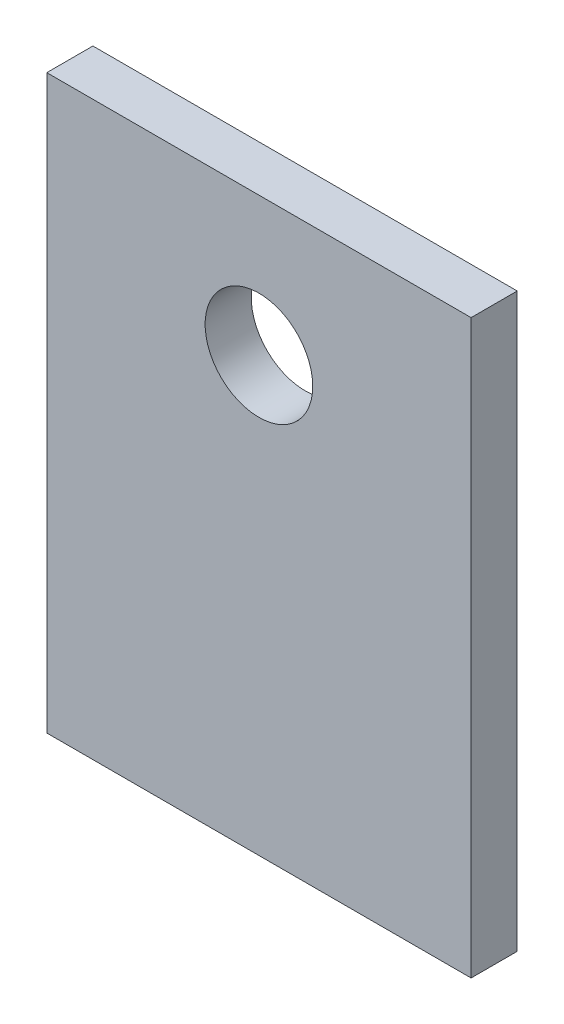
ISO-10303-21;
HEADER;
FILE_DESCRIPTION(('STEP AP214'),'2;1');
FILE_NAME('part.step','',(''),(''),'','','');
FILE_SCHEMA(('AUTOMOTIVE_DESIGN { 1 0 10303 214 1 1 1 1 }'));
ENDSEC;
DATA;
#1=APPLICATION_CONTEXT('core data for automotive mechanical design processes');
#2=APPLICATION_PROTOCOL_DEFINITION('international standard','automotive_design',2000,#1);
#3=PRODUCT_CONTEXT('',#1,'mechanical');
#4=PRODUCT('Part','Part','',(#3));
#5=PRODUCT_RELATED_PRODUCT_CATEGORY('part','',(#4));
#6=PRODUCT_DEFINITION_FORMATION('','',#4);
#7=PRODUCT_DEFINITION_CONTEXT('part definition',#1,'design');
#8=PRODUCT_DEFINITION('design','',#6,#7);
#9=PRODUCT_DEFINITION_SHAPE('','',#8);
#10=(LENGTH_UNIT() NAMED_UNIT(*) SI_UNIT(.MILLI.,.METRE.));
#11=(NAMED_UNIT(*) PLANE_ANGLE_UNIT() SI_UNIT($,.RADIAN.));
#12=(NAMED_UNIT(*) SI_UNIT($,.STERADIAN.) SOLID_ANGLE_UNIT());
#13=UNCERTAINTY_MEASURE_WITH_UNIT(LENGTH_MEASURE(1.E-05),#10,'distance_accuracy_value','');
#14=(GEOMETRIC_REPRESENTATION_CONTEXT(3) GLOBAL_UNCERTAINTY_ASSIGNED_CONTEXT((#13)) GLOBAL_UNIT_ASSIGNED_CONTEXT((#10,
#11,#12)) REPRESENTATION_CONTEXT('',''));
#15=CARTESIAN_POINT('',(0.,0.,0.));
#16=DIRECTION('',(0.,0.,1.));
#17=DIRECTION('',(1.,0.,0.));
#18=AXIS2_PLACEMENT_3D('',#15,#16,#17);
#19=CARTESIAN_POINT('',(0.,0.,1.5));
#20=DIRECTION('',(0.,0.,1.));
#21=DIRECTION('',(1.,0.,0.));
#22=AXIS2_PLACEMENT_3D('',#19,#20,#21);
#23=PLANE('',#22);
#24=DIRECTION('',(0.,1.,0.));
#25=VECTOR('',#24,1.);
#26=CARTESIAN_POINT('',(6.9,-9.3,1.5));
#27=LINE('',#26,#25);
#28=CARTESIAN_POINT('',(6.9,-9.3,1.5));
#29=VERTEX_POINT('',#28);
#30=CARTESIAN_POINT('',(6.9,9.3,1.5));
#31=VERTEX_POINT('',#30);
#32=EDGE_CURVE('E87',#29,#31,#27,.T.);
#33=ORIENTED_EDGE('',*,*,#32,.T.);
#34=DIRECTION('',(-1.,0.,0.));
#35=VECTOR('',#34,1.);
#36=CARTESIAN_POINT('',(6.9,9.3,1.5));
#37=LINE('',#36,#35);
#38=CARTESIAN_POINT('',(-6.9,9.3,1.5));
#39=VERTEX_POINT('',#38);
#40=EDGE_CURVE('E82',#31,#39,#37,.T.);
#41=ORIENTED_EDGE('',*,*,#40,.T.);
#42=DIRECTION('',(0.,-1.,0.));
#43=VECTOR('',#42,1.);
#44=CARTESIAN_POINT('',(-6.9,9.3,1.5));
#45=LINE('',#44,#43);
#46=CARTESIAN_POINT('',(-6.9,-9.3,1.5));
#47=VERTEX_POINT('',#46);
#48=EDGE_CURVE('E85',#39,#47,#45,.T.);
#49=ORIENTED_EDGE('',*,*,#48,.T.);
#50=DIRECTION('',(1.,0.,0.));
#51=VECTOR('',#50,1.);
#52=CARTESIAN_POINT('',(-6.9,-9.3,1.5));
#53=LINE('',#52,#51);
#54=EDGE_CURVE('E52',#47,#29,#53,.T.);
#55=ORIENTED_EDGE('',*,*,#54,.T.);
#56=EDGE_LOOP('',(#33,#41,#49,#55));
#57=FACE_BOUND('',#56,.T.);
#58=CARTESIAN_POINT('',(0.,4.79,1.5));
#59=DIRECTION('',(0.,0.,1.));
#60=DIRECTION('',(1.,0.,0.));
#61=AXIS2_PLACEMENT_3D('',#58,#59,#60);
#62=CIRCLE('',#61,1.75);
#63=CARTESIAN_POINT('',(1.75,4.79,1.5));
#64=VERTEX_POINT('',#63);
#65=EDGE_CURVE('E102',#64,#64,#62,.T.);
#66=ORIENTED_EDGE('',*,*,#65,.F.);
#67=EDGE_LOOP('',(#66));
#68=FACE_BOUND('',#67,.T.);
#69=ADVANCED_FACE('F35',(#57,#68),#23,.T.);
#70=CARTESIAN_POINT('',(0.,0.,0.));
#71=DIRECTION('',(0.,0.,1.));
#72=DIRECTION('',(1.,0.,0.));
#73=AXIS2_PLACEMENT_3D('',#70,#71,#72);
#74=PLANE('',#73);
#75=DIRECTION('',(0.,1.,0.));
#76=VECTOR('',#75,1.);
#77=CARTESIAN_POINT('',(6.9,-9.3,0.));
#78=LINE('',#77,#76);
#79=CARTESIAN_POINT('',(6.9,-9.3,0.));
#80=VERTEX_POINT('',#79);
#81=CARTESIAN_POINT('',(6.9,9.3,0.));
#82=VERTEX_POINT('',#81);
#83=EDGE_CURVE('E99',#80,#82,#78,.T.);
#84=ORIENTED_EDGE('',*,*,#83,.F.);
#85=DIRECTION('',(1.,0.,0.));
#86=VECTOR('',#85,1.);
#87=CARTESIAN_POINT('',(-6.9,-9.3,0.));
#88=LINE('',#87,#86);
#89=CARTESIAN_POINT('',(-6.9,-9.3,0.));
#90=VERTEX_POINT('',#89);
#91=EDGE_CURVE('E75',#90,#80,#88,.T.);
#92=ORIENTED_EDGE('',*,*,#91,.F.);
#93=DIRECTION('',(0.,-1.,0.));
#94=VECTOR('',#93,1.);
#95=CARTESIAN_POINT('',(-6.9,9.3,0.));
#96=LINE('',#95,#94);
#97=CARTESIAN_POINT('',(-6.9,9.3,0.));
#98=VERTEX_POINT('',#97);
#99=EDGE_CURVE('E69',#98,#90,#96,.T.);
#100=ORIENTED_EDGE('',*,*,#99,.F.);
#101=DIRECTION('',(-1.,0.,0.));
#102=VECTOR('',#101,1.);
#103=CARTESIAN_POINT('',(6.9,9.3,0.));
#104=LINE('',#103,#102);
#105=EDGE_CURVE('E91',#82,#98,#104,.T.);
#106=ORIENTED_EDGE('',*,*,#105,.F.);
#107=EDGE_LOOP('',(#84,#92,#100,#106));
#108=FACE_BOUND('',#107,.T.);
#109=CARTESIAN_POINT('',(0.,4.79,0.));
#110=DIRECTION('',(0.,0.,1.));
#111=DIRECTION('',(1.,0.,0.));
#112=AXIS2_PLACEMENT_3D('',#109,#110,#111);
#113=CIRCLE('',#112,1.75);
#114=CARTESIAN_POINT('',(1.75,4.79,0.));
#115=VERTEX_POINT('',#114);
#116=EDGE_CURVE('E114',#115,#115,#113,.T.);
#117=ORIENTED_EDGE('',*,*,#116,.T.);
#118=EDGE_LOOP('',(#117));
#119=FACE_BOUND('',#118,.T.);
#120=ADVANCED_FACE('F110',(#108,#119),#74,.F.);
#121=CARTESIAN_POINT('',(6.9,-9.3,1.5));
#122=DIRECTION('',(-1.,0.,0.));
#123=DIRECTION('',(0.,0.,1.));
#124=AXIS2_PLACEMENT_3D('',#121,#122,#123);
#125=PLANE('',#124);
#126=ORIENTED_EDGE('',*,*,#83,.T.);
#127=DIRECTION('',(0.,0.,-1.));
#128=VECTOR('',#127,1.);
#129=CARTESIAN_POINT('',(6.9,9.3,1.5));
#130=LINE('',#129,#128);
#131=EDGE_CURVE('E11',#31,#82,#130,.T.);
#132=ORIENTED_EDGE('',*,*,#131,.F.);
#133=ORIENTED_EDGE('',*,*,#32,.F.);
#134=DIRECTION('',(0.,0.,-1.));
#135=VECTOR('',#134,1.);
#136=CARTESIAN_POINT('',(6.9,-9.3,1.5));
#137=LINE('',#136,#135);
#138=EDGE_CURVE('E95',#29,#80,#137,.T.);
#139=ORIENTED_EDGE('',*,*,#138,.T.);
#140=EDGE_LOOP('',(#126,#132,#133,#139));
#141=FACE_BOUND('',#140,.T.);
#142=ADVANCED_FACE('F37',(#141),#125,.F.);
#143=CARTESIAN_POINT('',(6.9,9.3,1.5));
#144=DIRECTION('',(0.,-1.,0.));
#145=DIRECTION('',(0.,0.,-1.));
#146=AXIS2_PLACEMENT_3D('',#143,#144,#145);
#147=PLANE('',#146);
#148=ORIENTED_EDGE('',*,*,#105,.T.);
#149=DIRECTION('',(0.,0.,-1.));
#150=VECTOR('',#149,1.);
#151=CARTESIAN_POINT('',(-6.9,9.3,1.5));
#152=LINE('',#151,#150);
#153=EDGE_CURVE('E44',#39,#98,#152,.T.);
#154=ORIENTED_EDGE('',*,*,#153,.F.);
#155=ORIENTED_EDGE('',*,*,#40,.F.);
#156=ORIENTED_EDGE('',*,*,#131,.T.);
#157=EDGE_LOOP('',(#148,#154,#155,#156));
#158=FACE_BOUND('',#157,.T.);
#159=ADVANCED_FACE('F90',(#158),#147,.F.);
#160=CARTESIAN_POINT('',(-6.9,9.3,1.5));
#161=DIRECTION('',(1.,0.,0.));
#162=DIRECTION('',(0.,0.,-1.));
#163=AXIS2_PLACEMENT_3D('',#160,#161,#162);
#164=PLANE('',#163);
#165=ORIENTED_EDGE('',*,*,#99,.T.);
#166=DIRECTION('',(0.,0.,-1.));
#167=VECTOR('',#166,1.);
#168=CARTESIAN_POINT('',(-6.9,-9.3,1.5));
#169=LINE('',#168,#167);
#170=EDGE_CURVE('E92',#47,#90,#169,.T.);
#171=ORIENTED_EDGE('',*,*,#170,.F.);
#172=ORIENTED_EDGE('',*,*,#48,.F.);
#173=ORIENTED_EDGE('',*,*,#153,.T.);
#174=EDGE_LOOP('',(#165,#171,#172,#173));
#175=FACE_BOUND('',#174,.T.);
#176=ADVANCED_FACE('F93',(#175),#164,.F.);
#177=CARTESIAN_POINT('',(-6.9,-9.3,1.5));
#178=DIRECTION('',(0.,1.,0.));
#179=DIRECTION('',(0.,0.,1.));
#180=AXIS2_PLACEMENT_3D('',#177,#178,#179);
#181=PLANE('',#180);
#182=ORIENTED_EDGE('',*,*,#91,.T.);
#183=ORIENTED_EDGE('',*,*,#138,.F.);
#184=ORIENTED_EDGE('',*,*,#54,.F.);
#185=ORIENTED_EDGE('',*,*,#170,.T.);
#186=EDGE_LOOP('',(#182,#183,#184,#185));
#187=FACE_BOUND('',#186,.T.);
#188=ADVANCED_FACE('F107',(#187),#181,.F.);
#189=CARTESIAN_POINT('',(0.,4.79,1.5));
#190=DIRECTION('',(0.,0.,-1.));
#191=DIRECTION('',(-1.,0.,0.));
#192=AXIS2_PLACEMENT_3D('',#189,#190,#191);
#193=CYLINDRICAL_SURFACE('',#192,1.75);
#194=ORIENTED_EDGE('',*,*,#65,.T.);
#195=EDGE_LOOP('',(#194));
#196=FACE_BOUND('',#195,.T.);
#197=ORIENTED_EDGE('',*,*,#116,.F.);
#198=EDGE_LOOP('',(#197));
#199=FACE_BOUND('',#198,.T.);
#200=ADVANCED_FACE('F120',(#196,#199),#193,.F.);
#201=CLOSED_SHELL('',(#69,#120,#142,#159,#176,#188,#200));
#202=MANIFOLD_SOLID_BREP('B2',#201);
#203=ADVANCED_BREP_SHAPE_REPRESENTATION('',(#18,#202),#14);
#204=SHAPE_DEFINITION_REPRESENTATION(#9,#203);
ENDSEC;
END-ISO-10303-21;
